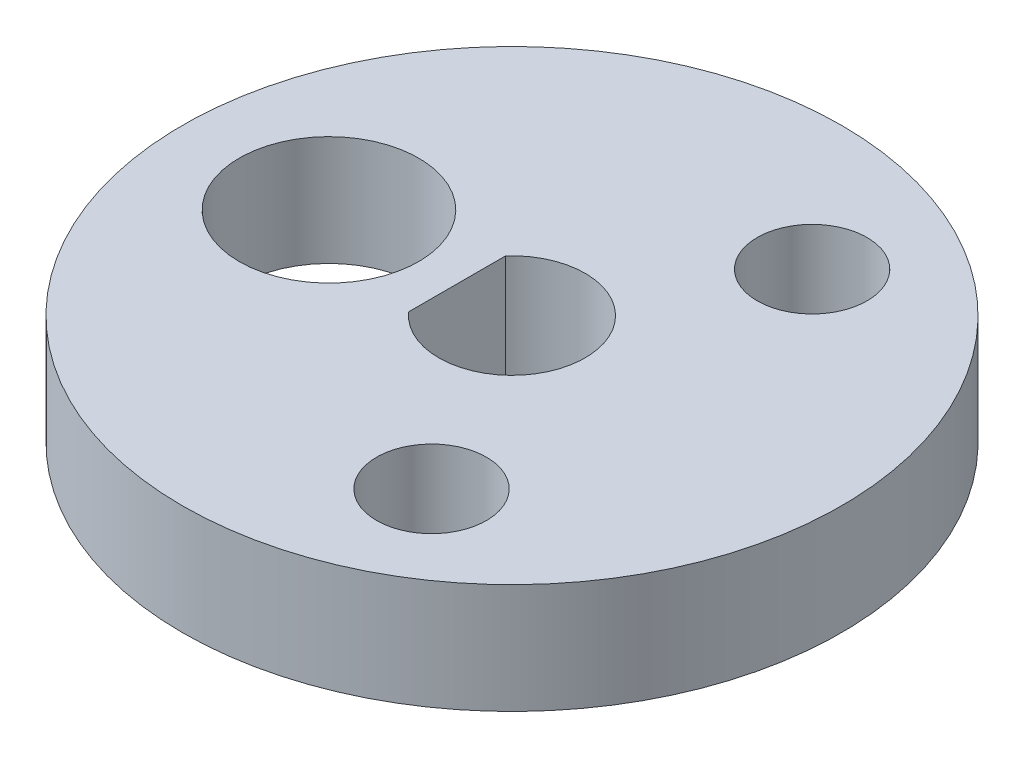
ISO-10303-21;
HEADER;
FILE_DESCRIPTION(('STEP AP214'),'2;1');
FILE_NAME('part.step','',(''),(''),'','','');
FILE_SCHEMA(('AUTOMOTIVE_DESIGN { 1 0 10303 214 1 1 1 1 }'));
ENDSEC;
DATA;
#1=APPLICATION_CONTEXT('core data for automotive mechanical design processes');
#2=APPLICATION_PROTOCOL_DEFINITION('international standard','automotive_design',2000,#1);
#3=PRODUCT_CONTEXT('',#1,'mechanical');
#4=PRODUCT('Part','Part','',(#3));
#5=PRODUCT_RELATED_PRODUCT_CATEGORY('part','',(#4));
#6=PRODUCT_DEFINITION_FORMATION('','',#4);
#7=PRODUCT_DEFINITION_CONTEXT('part definition',#1,'design');
#8=PRODUCT_DEFINITION('design','',#6,#7);
#9=PRODUCT_DEFINITION_SHAPE('','',#8);
#10=(LENGTH_UNIT() NAMED_UNIT(*) SI_UNIT(.MILLI.,.METRE.));
#11=(NAMED_UNIT(*) PLANE_ANGLE_UNIT() SI_UNIT($,.RADIAN.));
#12=(NAMED_UNIT(*) SI_UNIT($,.STERADIAN.) SOLID_ANGLE_UNIT());
#13=UNCERTAINTY_MEASURE_WITH_UNIT(LENGTH_MEASURE(1.E-05),#10,'distance_accuracy_value','');
#14=(GEOMETRIC_REPRESENTATION_CONTEXT(3) GLOBAL_UNCERTAINTY_ASSIGNED_CONTEXT((#13)) GLOBAL_UNIT_ASSIGNED_CONTEXT((#10,
#11,#12)) REPRESENTATION_CONTEXT('',''));
#15=CARTESIAN_POINT('',(0.,0.,0.));
#16=DIRECTION('',(0.,0.,1.));
#17=DIRECTION('',(1.,0.,0.));
#18=AXIS2_PLACEMENT_3D('',#15,#16,#17);
#19=CARTESIAN_POINT('',(0.,3.,0.));
#20=DIRECTION('',(0.,1.,0.));
#21=DIRECTION('',(0.,0.,1.));
#22=AXIS2_PLACEMENT_3D('',#19,#20,#21);
#23=PLANE('',#22);
#24=CARTESIAN_POINT('',(2.99913195908428,3.,5.19665348969885));
#25=DIRECTION('',(0.,1.,0.));
#26=DIRECTION('',(0.,0.,1.));
#27=AXIS2_PLACEMENT_3D('',#24,#25,#26);
#28=CIRCLE('',#27,1.5);
#29=CARTESIAN_POINT('',(2.99913195908428,3.,6.69665348969885));
#30=VERTEX_POINT('',#29);
#31=EDGE_CURVE('E105',#30,#30,#28,.T.);
#32=ORIENTED_EDGE('',*,*,#31,.F.);
#33=EDGE_LOOP('',(#32));
#34=FACE_BOUND('',#33,.T.);
#35=DIRECTION('',(-0.000167046496774935,0.,0.999999986047734));
#36=VECTOR('',#35,1.);
#37=CARTESIAN_POINT('',(-1.49977899732768,3.,-1.32312620682034));
#38=LINE('',#37,#36);
#39=CARTESIAN_POINT('',(-1.49977899732768,3.,-1.32312620682034));
#40=VERTEX_POINT('',#39);
#41=CARTESIAN_POINT('',(-1.50022096081553,3.,1.32262506733002));
#42=VERTEX_POINT('',#41);
#43=EDGE_CURVE('E96',#40,#42,#38,.T.);
#44=ORIENTED_EDGE('',*,*,#43,.F.);
#45=CARTESIAN_POINT('',(0.,3.,0.));
#46=DIRECTION('',(0.,1.,0.));
#47=DIRECTION('',(0.,0.,1.));
#48=AXIS2_PLACEMENT_3D('',#45,#46,#47);
#49=CIRCLE('',#48,2.);
#50=EDGE_CURVE('E79',#42,#40,#49,.T.);
#51=ORIENTED_EDGE('',*,*,#50,.F.);
#52=EDGE_LOOP('',(#44,#51));
#53=FACE_BOUND('',#52,.T.);
#54=CARTESIAN_POINT('',(0.,3.,0.));
#55=DIRECTION('',(0.,1.,0.));
#56=DIRECTION('',(0.,0.,1.));
#57=AXIS2_PLACEMENT_3D('',#54,#55,#56);
#58=CIRCLE('',#57,9.);
#59=CARTESIAN_POINT('',(0.,3.,9.));
#60=VERTEX_POINT('',#59);
#61=EDGE_CURVE('E11',#60,#60,#58,.T.);
#62=ORIENTED_EDGE('',*,*,#61,.T.);
#63=EDGE_LOOP('',(#62));
#64=FACE_BOUND('',#63,.T.);
#65=CARTESIAN_POINT('',(-5.,3.,-0.000835232483875));
#66=DIRECTION('',(0.,1.,0.));
#67=DIRECTION('',(0.,0.,1.));
#68=AXIS2_PLACEMENT_3D('',#65,#66,#67);
#69=CIRCLE('',#68,2.45);
#70=CARTESIAN_POINT('',(-5.,3.,2.44916476751613));
#71=VERTEX_POINT('',#70);
#72=EDGE_CURVE('E89',#71,#71,#69,.T.);
#73=ORIENTED_EDGE('',*,*,#72,.F.);
#74=EDGE_LOOP('',(#73));
#75=FACE_BOUND('',#74,.T.);
#76=CARTESIAN_POINT('',(3.00086795720212,3.,-5.19565121071821));
#77=DIRECTION('',(0.,1.,0.));
#78=DIRECTION('',(0.,0.,1.));
#79=AXIS2_PLACEMENT_3D('',#76,#77,#78);
#80=CIRCLE('',#79,1.5);
#81=CARTESIAN_POINT('',(3.00086795720212,3.,-3.6956512107182));
#82=VERTEX_POINT('',#81);
#83=EDGE_CURVE('E111',#82,#82,#80,.T.);
#84=ORIENTED_EDGE('',*,*,#83,.F.);
#85=EDGE_LOOP('',(#84));
#86=FACE_BOUND('',#85,.T.);
#87=ADVANCED_FACE('F45',(#34,#53,#64,#75,#86),#23,.T.);
#88=CARTESIAN_POINT('',(0.,0.,0.));
#89=DIRECTION('',(0.,1.,0.));
#90=DIRECTION('',(0.,0.,1.));
#91=AXIS2_PLACEMENT_3D('',#88,#89,#90);
#92=PLANE('',#91);
#93=CARTESIAN_POINT('',(0.,0.,0.));
#94=DIRECTION('',(0.,1.,0.));
#95=DIRECTION('',(0.,0.,1.));
#96=AXIS2_PLACEMENT_3D('',#93,#94,#95);
#97=CIRCLE('',#96,9.);
#98=CARTESIAN_POINT('',(0.,0.,9.));
#99=VERTEX_POINT('',#98);
#100=EDGE_CURVE('E49',#99,#99,#97,.T.);
#101=ORIENTED_EDGE('',*,*,#100,.F.);
#102=EDGE_LOOP('',(#101));
#103=FACE_BOUND('',#102,.T.);
#104=CARTESIAN_POINT('',(0.,0.,0.));
#105=DIRECTION('',(0.,1.,0.));
#106=DIRECTION('',(0.,0.,1.));
#107=AXIS2_PLACEMENT_3D('',#104,#105,#106);
#108=CIRCLE('',#107,2.);
#109=CARTESIAN_POINT('',(-1.50022096081553,0.,1.32262506733002));
#110=VERTEX_POINT('',#109);
#111=CARTESIAN_POINT('',(-1.49977899732768,0.,-1.32312620682034));
#112=VERTEX_POINT('',#111);
#113=EDGE_CURVE('E68',#110,#112,#108,.T.);
#114=ORIENTED_EDGE('',*,*,#113,.T.);
#115=DIRECTION('',(-0.000167046496774935,0.,0.999999986047734));
#116=VECTOR('',#115,1.);
#117=CARTESIAN_POINT('',(-1.49977899732768,0.,-1.32312620682034));
#118=LINE('',#117,#116);
#119=EDGE_CURVE('E74',#112,#110,#118,.T.);
#120=ORIENTED_EDGE('',*,*,#119,.T.);
#121=EDGE_LOOP('',(#114,#120));
#122=FACE_BOUND('',#121,.T.);
#123=CARTESIAN_POINT('',(-5.,0.,-0.000835232483875));
#124=DIRECTION('',(0.,1.,0.));
#125=DIRECTION('',(0.,0.,1.));
#126=AXIS2_PLACEMENT_3D('',#123,#124,#125);
#127=CIRCLE('',#126,2.45);
#128=CARTESIAN_POINT('',(-5.,0.,2.44916476751613));
#129=VERTEX_POINT('',#128);
#130=EDGE_CURVE('E93',#129,#129,#127,.T.);
#131=ORIENTED_EDGE('',*,*,#130,.T.);
#132=EDGE_LOOP('',(#131));
#133=FACE_BOUND('',#132,.T.);
#134=CARTESIAN_POINT('',(2.99913195908428,0.,5.19665348969885));
#135=DIRECTION('',(0.,1.,0.));
#136=DIRECTION('',(0.,0.,1.));
#137=AXIS2_PLACEMENT_3D('',#134,#135,#136);
#138=CIRCLE('',#137,1.5);
#139=CARTESIAN_POINT('',(2.99913195908428,0.,6.69665348969885));
#140=VERTEX_POINT('',#139);
#141=EDGE_CURVE('E107',#140,#140,#138,.T.);
#142=ORIENTED_EDGE('',*,*,#141,.T.);
#143=EDGE_LOOP('',(#142));
#144=FACE_BOUND('',#143,.T.);
#145=CARTESIAN_POINT('',(3.00086795720212,0.,-5.19565121071821));
#146=DIRECTION('',(0.,1.,0.));
#147=DIRECTION('',(0.,0.,1.));
#148=AXIS2_PLACEMENT_3D('',#145,#146,#147);
#149=CIRCLE('',#148,1.5);
#150=CARTESIAN_POINT('',(3.00086795720212,0.,-3.6956512107182));
#151=VERTEX_POINT('',#150);
#152=EDGE_CURVE('E115',#151,#151,#149,.T.);
#153=ORIENTED_EDGE('',*,*,#152,.T.);
#154=EDGE_LOOP('',(#153));
#155=FACE_BOUND('',#154,.T.);
#156=ADVANCED_FACE('F86',(#103,#122,#133,#144,#155),#92,.F.);
#157=CARTESIAN_POINT('',(0.,3.,0.));
#158=DIRECTION('',(0.,-1.,0.));
#159=DIRECTION('',(0.,0.,-1.));
#160=AXIS2_PLACEMENT_3D('',#157,#158,#159);
#161=CYLINDRICAL_SURFACE('',#160,9.);
#162=ORIENTED_EDGE('',*,*,#61,.F.);
#163=EDGE_LOOP('',(#162));
#164=FACE_BOUND('',#163,.T.);
#165=ORIENTED_EDGE('',*,*,#100,.T.);
#166=EDGE_LOOP('',(#165));
#167=FACE_BOUND('',#166,.T.);
#168=ADVANCED_FACE('F47',(#164,#167),#161,.T.);
#169=CARTESIAN_POINT('',(0.,3.,0.));
#170=DIRECTION('',(0.,-1.,0.));
#171=DIRECTION('',(0.,0.,-1.));
#172=AXIS2_PLACEMENT_3D('',#169,#170,#171);
#173=CYLINDRICAL_SURFACE('',#172,2.);
#174=ORIENTED_EDGE('',*,*,#113,.F.);
#175=DIRECTION('',(0.,-1.,0.));
#176=VECTOR('',#175,1.);
#177=CARTESIAN_POINT('',(-1.50022096081553,3.,1.32262506733002));
#178=LINE('',#177,#176);
#179=EDGE_CURVE('E76',#42,#110,#178,.T.);
#180=ORIENTED_EDGE('',*,*,#179,.F.);
#181=ORIENTED_EDGE('',*,*,#50,.T.);
#182=DIRECTION('',(0.,-1.,0.));
#183=VECTOR('',#182,1.);
#184=CARTESIAN_POINT('',(-1.49977899732768,3.,-1.32312620682034));
#185=LINE('',#184,#183);
#186=EDGE_CURVE('E61',#40,#112,#185,.T.);
#187=ORIENTED_EDGE('',*,*,#186,.T.);
#188=EDGE_LOOP('',(#174,#180,#181,#187));
#189=FACE_BOUND('',#188,.T.);
#190=ADVANCED_FACE('F81',(#189),#173,.F.);
#191=CARTESIAN_POINT('',(-1.49977899732768,3.,-1.32312620682034));
#192=DIRECTION('',(0.999999986047734,0.,0.000167046496774935));
#193=DIRECTION('',(0.000167046496774935,0.,-0.999999986047734));
#194=AXIS2_PLACEMENT_3D('',#191,#192,#193);
#195=PLANE('',#194);
#196=ORIENTED_EDGE('',*,*,#119,.F.);
#197=ORIENTED_EDGE('',*,*,#186,.F.);
#198=ORIENTED_EDGE('',*,*,#43,.T.);
#199=ORIENTED_EDGE('',*,*,#179,.T.);
#200=EDGE_LOOP('',(#196,#197,#198,#199));
#201=FACE_BOUND('',#200,.T.);
#202=ADVANCED_FACE('F75',(#201),#195,.T.);
#203=CARTESIAN_POINT('',(-5.,3.,-0.000835232483875));
#204=DIRECTION('',(0.,-1.,0.));
#205=DIRECTION('',(0.,0.,-1.));
#206=AXIS2_PLACEMENT_3D('',#203,#204,#205);
#207=CYLINDRICAL_SURFACE('',#206,2.45);
#208=ORIENTED_EDGE('',*,*,#72,.T.);
#209=EDGE_LOOP('',(#208));
#210=FACE_BOUND('',#209,.T.);
#211=ORIENTED_EDGE('',*,*,#130,.F.);
#212=EDGE_LOOP('',(#211));
#213=FACE_BOUND('',#212,.T.);
#214=ADVANCED_FACE('F140',(#210,#213),#207,.F.);
#215=CARTESIAN_POINT('',(2.99913195908428,3.,5.19665348969885));
#216=DIRECTION('',(0.,-1.,0.));
#217=DIRECTION('',(0.,0.,-1.));
#218=AXIS2_PLACEMENT_3D('',#215,#216,#217);
#219=CYLINDRICAL_SURFACE('',#218,1.5);
#220=ORIENTED_EDGE('',*,*,#31,.T.);
#221=EDGE_LOOP('',(#220));
#222=FACE_BOUND('',#221,.T.);
#223=ORIENTED_EDGE('',*,*,#141,.F.);
#224=EDGE_LOOP('',(#223));
#225=FACE_BOUND('',#224,.T.);
#226=ADVANCED_FACE('F143',(#222,#225),#219,.F.);
#227=CARTESIAN_POINT('',(3.00086795720212,3.,-5.19565121071821));
#228=DIRECTION('',(0.,-1.,0.));
#229=DIRECTION('',(0.,0.,-1.));
#230=AXIS2_PLACEMENT_3D('',#227,#228,#229);
#231=CYLINDRICAL_SURFACE('',#230,1.5);
#232=ORIENTED_EDGE('',*,*,#83,.T.);
#233=EDGE_LOOP('',(#232));
#234=FACE_BOUND('',#233,.T.);
#235=ORIENTED_EDGE('',*,*,#152,.F.);
#236=EDGE_LOOP('',(#235));
#237=FACE_BOUND('',#236,.T.);
#238=ADVANCED_FACE('F123',(#234,#237),#231,.F.);
#239=CLOSED_SHELL('',(#87,#156,#168,#190,#202,#214,#226,#238));
#240=MANIFOLD_SOLID_BREP('B2',#239);
#241=ADVANCED_BREP_SHAPE_REPRESENTATION('',(#18,#240),#14);
#242=SHAPE_DEFINITION_REPRESENTATION(#9,#241);
ENDSEC;
END-ISO-10303-21;
